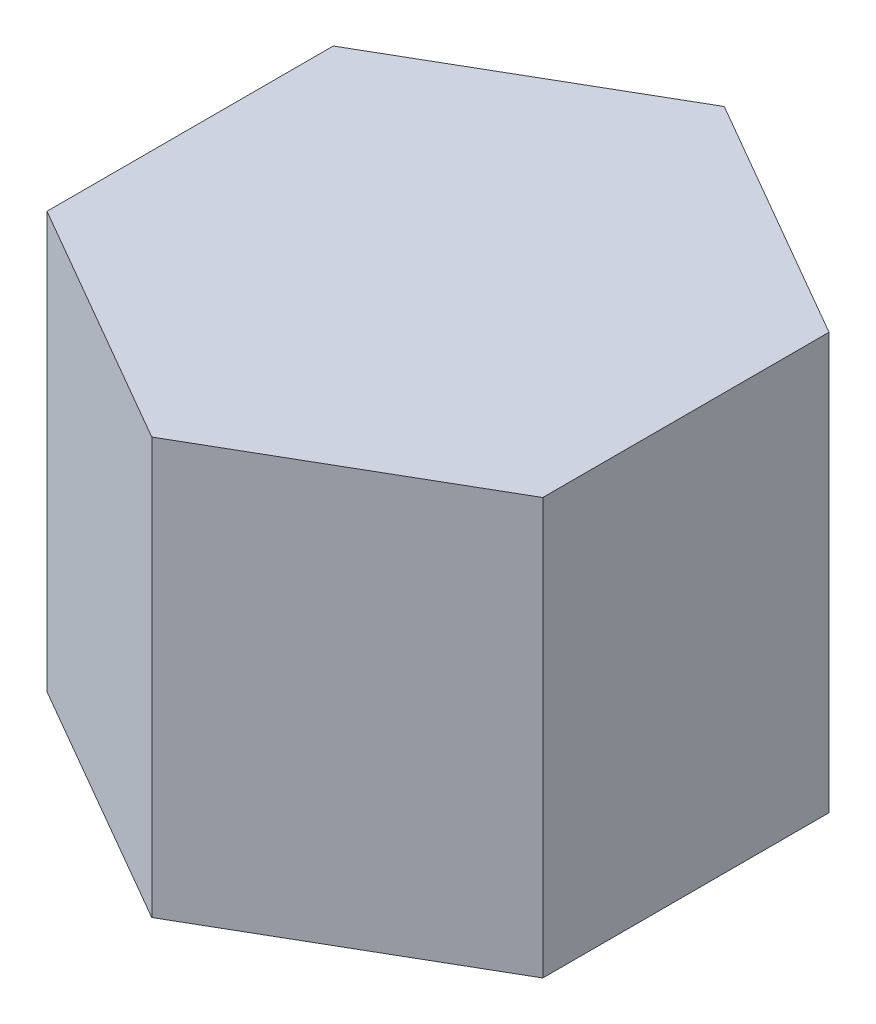
ISO-10303-21;
HEADER;
FILE_DESCRIPTION(('STEP AP214'),'2;1');
FILE_NAME('part.step','',(''),(''),'','','');
FILE_SCHEMA(('AUTOMOTIVE_DESIGN { 1 0 10303 214 1 1 1 1 }'));
ENDSEC;
DATA;
#1=APPLICATION_CONTEXT('core data for automotive mechanical design processes');
#2=APPLICATION_PROTOCOL_DEFINITION('international standard','automotive_design',2000,#1);
#3=PRODUCT_CONTEXT('',#1,'mechanical');
#4=PRODUCT('Part','Part','',(#3));
#5=PRODUCT_RELATED_PRODUCT_CATEGORY('part','',(#4));
#6=PRODUCT_DEFINITION_FORMATION('','',#4);
#7=PRODUCT_DEFINITION_CONTEXT('part definition',#1,'design');
#8=PRODUCT_DEFINITION('design','',#6,#7);
#9=PRODUCT_DEFINITION_SHAPE('','',#8);
#10=(LENGTH_UNIT() NAMED_UNIT(*) SI_UNIT(.MILLI.,.METRE.));
#11=(NAMED_UNIT(*) PLANE_ANGLE_UNIT() SI_UNIT($,.RADIAN.));
#12=(NAMED_UNIT(*) SI_UNIT($,.STERADIAN.) SOLID_ANGLE_UNIT());
#13=UNCERTAINTY_MEASURE_WITH_UNIT(LENGTH_MEASURE(1.E-05),#10,'distance_accuracy_value','');
#14=(GEOMETRIC_REPRESENTATION_CONTEXT(3) GLOBAL_UNCERTAINTY_ASSIGNED_CONTEXT((#13)) GLOBAL_UNIT_ASSIGNED_CONTEXT((#10,
#11,#12)) REPRESENTATION_CONTEXT('',''));
#15=CARTESIAN_POINT('',(0.,0.,0.));
#16=DIRECTION('',(0.,0.,1.));
#17=DIRECTION('',(1.,0.,0.));
#18=AXIS2_PLACEMENT_3D('',#15,#16,#17);
#19=CARTESIAN_POINT('',(208.839551417382,-147.556598747966,292.547996624279));
#20=DIRECTION('',(-0.500000000000028,0.,-0.866025403784422));
#21=DIRECTION('',(-0.866025403784423,0.,0.500000000000028));
#22=AXIS2_PLACEMENT_3D('',#19,#20,#21);
#23=PLANE('',#22);
#24=CARTESIAN_POINT('',(209.142660308706,-147.047793579175,292.372996624279));
#25=DIRECTION('',(-0.866025403784422,0.,0.500000000000028));
#26=VECTOR('',#25,1.);
#27=LINE('',#24,#26);
#28=CARTESIAN_POINT('',(209.142660308706,-147.047793579175,292.372996624279));
#29=VERTEX_POINT('',#28);
#30=CARTESIAN_POINT('',(208.839551417382,-147.047793579175,292.547996624279));
#31=VERTEX_POINT('',#30);
#32=EDGE_CURVE('E170',#29,#31,#27,.T.);
#33=ORIENTED_EDGE('',*,*,#32,.T.);
#34=CARTESIAN_POINT('',(208.839551417382,-147.556598747966,292.547996624279));
#35=DIRECTION('',(0.,1.,0.));
#36=VECTOR('',#35,1.);
#37=LINE('',#34,#36);
#38=CARTESIAN_POINT('',(208.839551417382,-147.556598747966,292.547996624279));
#39=VERTEX_POINT('',#38);
#40=EDGE_CURVE('E35',#39,#31,#37,.T.);
#41=ORIENTED_EDGE('',*,*,#40,.F.);
#42=CARTESIAN_POINT('',(209.142660308706,-147.556598747966,292.372996624279));
#43=DIRECTION('',(-0.866025403784422,0.,0.500000000000028));
#44=VECTOR('',#43,1.);
#45=LINE('',#42,#44);
#46=CARTESIAN_POINT('',(209.142660308706,-147.556598747966,292.372996624279));
#47=VERTEX_POINT('',#46);
#48=EDGE_CURVE('E159',#47,#39,#45,.T.);
#49=ORIENTED_EDGE('',*,*,#48,.F.);
#50=CARTESIAN_POINT('',(209.142660308706,-147.556598747966,292.372996624279));
#51=DIRECTION('',(0.,1.,0.));
#52=VECTOR('',#51,1.);
#53=LINE('',#50,#52);
#54=EDGE_CURVE('E10',#47,#29,#53,.T.);
#55=ORIENTED_EDGE('',*,*,#54,.T.);
#56=EDGE_LOOP('',(#33,#41,#49,#55));
#57=FACE_BOUND('',#56,.T.);
#58=ADVANCED_FACE('F16',(#57),#23,.F.);
#59=CARTESIAN_POINT('',(209.142660308706,-147.556598747966,291.594471220494));
#60=DIRECTION('',(-1.,0.,0.));
#61=DIRECTION('',(0.,-1.,0.));
#62=AXIS2_PLACEMENT_3D('',#59,#60,#61);
#63=PLANE('',#62);
#64=CARTESIAN_POINT('',(209.142660308706,-147.047793579175,292.022996624279));
#65=DIRECTION('',(0.,0.,1.));
#66=VECTOR('',#65,1.);
#67=LINE('',#64,#66);
#68=CARTESIAN_POINT('',(209.142660308706,-147.047793579175,292.022996624279));
#69=VERTEX_POINT('',#68);
#70=EDGE_CURVE('E167',#69,#29,#67,.T.);
#71=ORIENTED_EDGE('',*,*,#70,.T.);
#72=ORIENTED_EDGE('',*,*,#54,.F.);
#73=CARTESIAN_POINT('',(209.142660308706,-147.556598747966,292.022996624279));
#74=DIRECTION('',(0.,0.,1.));
#75=VECTOR('',#74,1.);
#76=LINE('',#73,#75);
#77=CARTESIAN_POINT('',(209.142660308706,-147.556598747966,292.022996624279));
#78=VERTEX_POINT('',#77);
#79=EDGE_CURVE('E156',#78,#47,#76,.T.);
#80=ORIENTED_EDGE('',*,*,#79,.F.);
#81=CARTESIAN_POINT('',(209.142660308706,-147.556598747966,292.022996624279));
#82=DIRECTION('',(0.,1.,0.));
#83=VECTOR('',#82,1.);
#84=LINE('',#81,#83);
#85=EDGE_CURVE('E27',#78,#69,#84,.T.);
#86=ORIENTED_EDGE('',*,*,#85,.T.);
#87=EDGE_LOOP('',(#71,#72,#80,#86));
#88=FACE_BOUND('',#87,.T.);
#89=ADVANCED_FACE('F189',(#88),#63,.F.);
#90=CARTESIAN_POINT('',(209.142660308706,-147.556598747966,292.022996624279));
#91=DIRECTION('',(-0.500000000000062,0.,0.866025403784403));
#92=DIRECTION('',(0.866025403784403,0.,0.500000000000062));
#93=AXIS2_PLACEMENT_3D('',#90,#91,#92);
#94=PLANE('',#93);
#95=CARTESIAN_POINT('',(208.839551417382,-147.047793579175,291.847996624279));
#96=DIRECTION('',(0.866025403784403,0.,0.500000000000062));
#97=VECTOR('',#96,1.);
#98=LINE('',#95,#97);
#99=CARTESIAN_POINT('',(208.839551417382,-147.047793579175,291.847996624279));
#100=VERTEX_POINT('',#99);
#101=EDGE_CURVE('E163',#100,#69,#98,.T.);
#102=ORIENTED_EDGE('',*,*,#101,.T.);
#103=ORIENTED_EDGE('',*,*,#85,.F.);
#104=CARTESIAN_POINT('',(208.839551417382,-147.556598747966,291.847996624279));
#105=DIRECTION('',(0.866025403784403,0.,0.500000000000062));
#106=VECTOR('',#105,1.);
#107=LINE('',#104,#106);
#108=CARTESIAN_POINT('',(208.839551417382,-147.556598747966,291.847996624279));
#109=VERTEX_POINT('',#108);
#110=EDGE_CURVE('E106',#109,#78,#107,.T.);
#111=ORIENTED_EDGE('',*,*,#110,.F.);
#112=CARTESIAN_POINT('',(208.839551417382,-147.556598747966,291.847996624279));
#113=DIRECTION('',(0.,1.,0.));
#114=VECTOR('',#113,1.);
#115=LINE('',#112,#114);
#116=EDGE_CURVE('E94',#109,#100,#115,.T.);
#117=ORIENTED_EDGE('',*,*,#116,.T.);
#118=EDGE_LOOP('',(#102,#103,#111,#117));
#119=FACE_BOUND('',#118,.T.);
#120=ADVANCED_FACE('F198',(#119),#94,.F.);
#121=CARTESIAN_POINT('',(208.839551417382,-147.556598747966,291.847996624279));
#122=DIRECTION('',(0.499999999999943,0.,0.866025403784471));
#123=DIRECTION('',(0.866025403784471,0.,-0.499999999999943));
#124=AXIS2_PLACEMENT_3D('',#121,#122,#123);
#125=PLANE('',#124);
#126=CARTESIAN_POINT('',(208.536442526057,-147.047793579175,292.022996624279));
#127=DIRECTION('',(0.866025403784471,0.,-0.499999999999943));
#128=VECTOR('',#127,1.);
#129=LINE('',#126,#128);
#130=CARTESIAN_POINT('',(208.536442526057,-147.047793579175,292.022996624279));
#131=VERTEX_POINT('',#130);
#132=EDGE_CURVE('E162',#131,#100,#129,.T.);
#133=ORIENTED_EDGE('',*,*,#132,.T.);
#134=ORIENTED_EDGE('',*,*,#116,.F.);
#135=CARTESIAN_POINT('',(208.536442526057,-147.556598747966,292.022996624279));
#136=DIRECTION('',(0.866025403784471,0.,-0.499999999999943));
#137=VECTOR('',#136,1.);
#138=LINE('',#135,#137);
#139=CARTESIAN_POINT('',(208.536442526057,-147.556598747966,292.022996624279));
#140=VERTEX_POINT('',#139);
#141=EDGE_CURVE('E98',#140,#109,#138,.T.);
#142=ORIENTED_EDGE('',*,*,#141,.F.);
#143=CARTESIAN_POINT('',(208.536442526057,-147.556598747966,292.022996624279));
#144=DIRECTION('',(0.,1.,0.));
#145=VECTOR('',#144,1.);
#146=LINE('',#143,#145);
#147=EDGE_CURVE('E79',#140,#131,#146,.T.);
#148=ORIENTED_EDGE('',*,*,#147,.T.);
#149=EDGE_LOOP('',(#133,#134,#142,#148));
#150=FACE_BOUND('',#149,.T.);
#151=ADVANCED_FACE('F100',(#150),#125,.F.);
#152=CARTESIAN_POINT('',(208.536442526057,-147.556598747966,291.594471220494));
#153=DIRECTION('',(1.,0.,0.));
#154=DIRECTION('',(0.,1.,0.));
#155=AXIS2_PLACEMENT_3D('',#152,#153,#154);
#156=PLANE('',#155);
#157=CARTESIAN_POINT('',(208.536442526057,-147.047793579175,292.372996624279));
#158=DIRECTION('',(0.,0.,-1.));
#159=VECTOR('',#158,1.);
#160=LINE('',#157,#159);
#161=CARTESIAN_POINT('',(208.536442526057,-147.047793579175,292.372996624279));
#162=VERTEX_POINT('',#161);
#163=EDGE_CURVE('E88',#162,#131,#160,.T.);
#164=ORIENTED_EDGE('',*,*,#163,.T.);
#165=ORIENTED_EDGE('',*,*,#147,.F.);
#166=CARTESIAN_POINT('',(208.536442526057,-147.556598747966,292.372996624279));
#167=DIRECTION('',(0.,0.,-1.));
#168=VECTOR('',#167,1.);
#169=LINE('',#166,#168);
#170=CARTESIAN_POINT('',(208.536442526057,-147.556598747966,292.372996624279));
#171=VERTEX_POINT('',#170);
#172=EDGE_CURVE('E84',#171,#140,#169,.T.);
#173=ORIENTED_EDGE('',*,*,#172,.F.);
#174=CARTESIAN_POINT('',(208.536442526057,-147.556598747966,292.372996624279));
#175=DIRECTION('',(0.,1.,0.));
#176=VECTOR('',#175,1.);
#177=LINE('',#174,#176);
#178=EDGE_CURVE('E58',#171,#162,#177,.T.);
#179=ORIENTED_EDGE('',*,*,#178,.T.);
#180=EDGE_LOOP('',(#164,#165,#173,#179));
#181=FACE_BOUND('',#180,.T.);
#182=ADVANCED_FACE('F82',(#181),#156,.F.);
#183=CARTESIAN_POINT('',(208.536442526057,-147.556598747966,292.372996624279));
#184=DIRECTION('',(0.499999999999978,0.,-0.866025403784452));
#185=DIRECTION('',(-0.866025403784452,0.,-0.499999999999978));
#186=AXIS2_PLACEMENT_3D('',#183,#184,#185);
#187=PLANE('',#186);
#188=CARTESIAN_POINT('',(208.839551417382,-147.047793579175,292.547996624279));
#189=DIRECTION('',(-0.866025403784452,0.,-0.499999999999978));
#190=VECTOR('',#189,1.);
#191=LINE('',#188,#190);
#192=EDGE_CURVE('E160',#31,#162,#191,.T.);
#193=ORIENTED_EDGE('',*,*,#192,.T.);
#194=ORIENTED_EDGE('',*,*,#178,.F.);
#195=CARTESIAN_POINT('',(208.839551417382,-147.556598747966,292.547996624279));
#196=DIRECTION('',(-0.866025403784452,0.,-0.499999999999978));
#197=VECTOR('',#196,1.);
#198=LINE('',#195,#197);
#199=EDGE_CURVE('E112',#39,#171,#198,.T.);
#200=ORIENTED_EDGE('',*,*,#199,.F.);
#201=ORIENTED_EDGE('',*,*,#40,.T.);
#202=EDGE_LOOP('',(#193,#194,#200,#201));
#203=FACE_BOUND('',#202,.T.);
#204=ADVANCED_FACE('F131',(#203),#187,.F.);
#205=CARTESIAN_POINT('',(206.491105863044,-147.556598747966,291.594471220494));
#206=DIRECTION('',(0.,1.,0.));
#207=DIRECTION('',(-1.,0.,0.));
#208=AXIS2_PLACEMENT_3D('',#205,#206,#207);
#209=PLANE('',#208);
#210=ORIENTED_EDGE('',*,*,#48,.T.);
#211=ORIENTED_EDGE('',*,*,#199,.T.);
#212=ORIENTED_EDGE('',*,*,#172,.T.);
#213=ORIENTED_EDGE('',*,*,#141,.T.);
#214=ORIENTED_EDGE('',*,*,#110,.T.);
#215=ORIENTED_EDGE('',*,*,#79,.T.);
#216=EDGE_LOOP('',(#210,#211,#212,#213,#214,#215));
#217=FACE_BOUND('',#216,.T.);
#218=ADVANCED_FACE('F111',(#217),#209,.F.);
#219=CARTESIAN_POINT('',(206.491105863044,-147.047793579175,291.594471220494));
#220=DIRECTION('',(0.,1.,0.));
#221=DIRECTION('',(-1.,0.,0.));
#222=AXIS2_PLACEMENT_3D('',#219,#220,#221);
#223=PLANE('',#222);
#224=ORIENTED_EDGE('',*,*,#32,.F.);
#225=ORIENTED_EDGE('',*,*,#70,.F.);
#226=ORIENTED_EDGE('',*,*,#101,.F.);
#227=ORIENTED_EDGE('',*,*,#132,.F.);
#228=ORIENTED_EDGE('',*,*,#163,.F.);
#229=ORIENTED_EDGE('',*,*,#192,.F.);
#230=EDGE_LOOP('',(#224,#225,#226,#227,#228,#229));
#231=FACE_BOUND('',#230,.T.);
#232=ADVANCED_FACE('F130',(#231),#223,.T.);
#233=CLOSED_SHELL('',(#58,#89,#120,#151,#182,#204,#218,#232));
#234=MANIFOLD_SOLID_BREP('B1',#233);
#235=ADVANCED_BREP_SHAPE_REPRESENTATION('',(#18,#234),#14);
#236=SHAPE_DEFINITION_REPRESENTATION(#9,#235);
ENDSEC;
END-ISO-10303-21;
